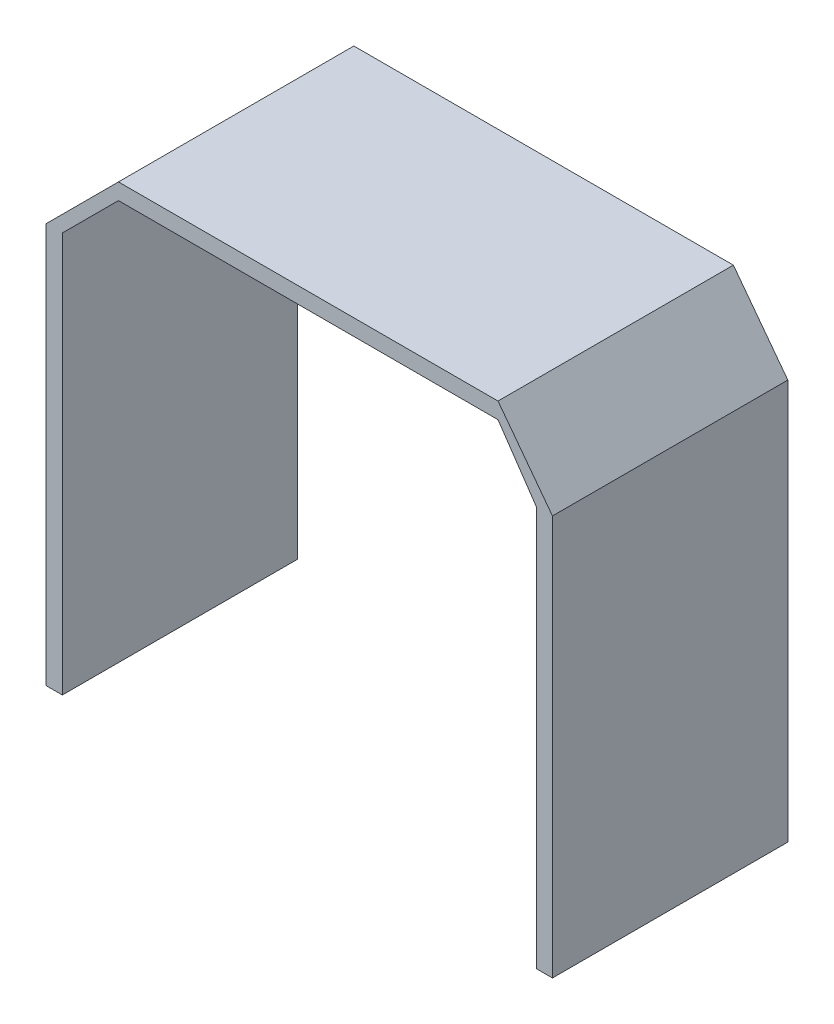
ISO-10303-21;
HEADER;
FILE_DESCRIPTION(('STEP AP214'),'2;1');
FILE_NAME('part.step','',(''),(''),'','','');
FILE_SCHEMA(('AUTOMOTIVE_DESIGN { 1 0 10303 214 1 1 1 1 }'));
ENDSEC;
DATA;
#1=APPLICATION_CONTEXT('core data for automotive mechanical design processes');
#2=APPLICATION_PROTOCOL_DEFINITION('international standard','automotive_design',2000,#1);
#3=PRODUCT_CONTEXT('',#1,'mechanical');
#4=PRODUCT('Part','Part','',(#3));
#5=PRODUCT_RELATED_PRODUCT_CATEGORY('part','',(#4));
#6=PRODUCT_DEFINITION_FORMATION('','',#4);
#7=PRODUCT_DEFINITION_CONTEXT('part definition',#1,'design');
#8=PRODUCT_DEFINITION('design','',#6,#7);
#9=PRODUCT_DEFINITION_SHAPE('','',#8);
#10=(LENGTH_UNIT() NAMED_UNIT(*) SI_UNIT(.MILLI.,.METRE.));
#11=(NAMED_UNIT(*) PLANE_ANGLE_UNIT() SI_UNIT($,.RADIAN.));
#12=(NAMED_UNIT(*) SI_UNIT($,.STERADIAN.) SOLID_ANGLE_UNIT());
#13=UNCERTAINTY_MEASURE_WITH_UNIT(LENGTH_MEASURE(1.E-05),#10,'distance_accuracy_value','');
#14=(GEOMETRIC_REPRESENTATION_CONTEXT(3) GLOBAL_UNCERTAINTY_ASSIGNED_CONTEXT((#13)) GLOBAL_UNIT_ASSIGNED_CONTEXT((#10,
#11,#12)) REPRESENTATION_CONTEXT('',''));
#15=CARTESIAN_POINT('',(0.,0.,0.));
#16=DIRECTION('',(0.,0.,1.));
#17=DIRECTION('',(1.,0.,0.));
#18=AXIS2_PLACEMENT_3D('',#15,#16,#17);
#19=CARTESIAN_POINT('',(-56.8011798622577,64.2288852711708,32.));
#20=DIRECTION('',(0.707106781186548,-0.707106781186547,0.));
#21=DIRECTION('',(0.707106781186547,0.707106781186548,0.));
#22=AXIS2_PLACEMENT_3D('',#19,#20,#21);
#23=PLANE('',#22);
#24=DIRECTION('',(-0.707106781186547,-0.707106781186548,0.));
#25=VECTOR('',#24,1.);
#26=CARTESIAN_POINT('',(-56.8011798622577,64.2288852711708,0.));
#27=LINE('',#26,#25);
#28=CARTESIAN_POINT('',(-56.8011798622577,64.2288852711708,0.));
#29=VERTEX_POINT('',#28);
#30=CARTESIAN_POINT('',(-66.6300651334285,54.4,0.));
#31=VERTEX_POINT('',#30);
#32=EDGE_CURVE('E160',#29,#31,#27,.T.);
#33=ORIENTED_EDGE('',*,*,#32,.T.);
#34=DIRECTION('',(0.,0.,-1.));
#35=VECTOR('',#34,1.);
#36=CARTESIAN_POINT('',(-66.6300651334285,54.4,32.));
#37=LINE('',#36,#35);
#38=CARTESIAN_POINT('',(-66.6300651334285,54.4,32.));
#39=VERTEX_POINT('',#38);
#40=EDGE_CURVE('E11',#39,#31,#37,.T.);
#41=ORIENTED_EDGE('',*,*,#40,.F.);
#42=DIRECTION('',(-0.707106781186547,-0.707106781186548,0.));
#43=VECTOR('',#42,1.);
#44=CARTESIAN_POINT('',(-56.8011798622577,64.2288852711708,32.));
#45=LINE('',#44,#43);
#46=CARTESIAN_POINT('',(-56.8011798622577,64.2288852711708,32.));
#47=VERTEX_POINT('',#46);
#48=EDGE_CURVE('E186',#47,#39,#45,.T.);
#49=ORIENTED_EDGE('',*,*,#48,.F.);
#50=DIRECTION('',(0.,0.,-1.));
#51=VECTOR('',#50,1.);
#52=CARTESIAN_POINT('',(-56.8011798622577,64.2288852711708,32.));
#53=LINE('',#52,#51);
#54=EDGE_CURVE('E156',#47,#29,#53,.T.);
#55=ORIENTED_EDGE('',*,*,#54,.T.);
#56=EDGE_LOOP('',(#33,#41,#49,#55));
#57=FACE_BOUND('',#56,.T.);
#58=ADVANCED_FACE('F41',(#57),#23,.F.);
#59=CARTESIAN_POINT('',(-66.6300651334285,54.4,32.));
#60=DIRECTION('',(1.,0.,0.));
#61=DIRECTION('',(0.,1.,0.));
#62=AXIS2_PLACEMENT_3D('',#59,#60,#61);
#63=PLANE('',#62);
#64=DIRECTION('',(0.,-1.,0.));
#65=VECTOR('',#64,1.);
#66=CARTESIAN_POINT('',(-66.6300651334285,54.4,0.));
#67=LINE('',#66,#65);
#68=CARTESIAN_POINT('',(-66.6300651334285,0.,0.));
#69=VERTEX_POINT('',#68);
#70=EDGE_CURVE('E163',#31,#69,#67,.T.);
#71=ORIENTED_EDGE('',*,*,#70,.T.);
#72=DIRECTION('',(0.,0.,-1.));
#73=VECTOR('',#72,1.);
#74=CARTESIAN_POINT('',(-66.6300651334285,0.,32.));
#75=LINE('',#74,#73);
#76=CARTESIAN_POINT('',(-66.6300651334285,0.,32.));
#77=VERTEX_POINT('',#76);
#78=EDGE_CURVE('E49',#77,#69,#75,.T.);
#79=ORIENTED_EDGE('',*,*,#78,.F.);
#80=DIRECTION('',(0.,-1.,0.));
#81=VECTOR('',#80,1.);
#82=CARTESIAN_POINT('',(-66.6300651334285,54.4,32.));
#83=LINE('',#82,#81);
#84=EDGE_CURVE('E108',#39,#77,#83,.T.);
#85=ORIENTED_EDGE('',*,*,#84,.F.);
#86=ORIENTED_EDGE('',*,*,#40,.T.);
#87=EDGE_LOOP('',(#71,#79,#85,#86));
#88=FACE_BOUND('',#87,.T.);
#89=ADVANCED_FACE('F260',(#88),#63,.F.);
#90=CARTESIAN_POINT('',(-66.6300651334285,0.,32.));
#91=DIRECTION('',(0.,1.,0.));
#92=DIRECTION('',(0.,0.,1.));
#93=AXIS2_PLACEMENT_3D('',#90,#91,#92);
#94=PLANE('',#93);
#95=DIRECTION('',(1.,0.,0.));
#96=VECTOR('',#95,1.);
#97=CARTESIAN_POINT('',(-66.6300651334285,0.,0.));
#98=LINE('',#97,#96);
#99=CARTESIAN_POINT('',(-64.4300651334285,0.,0.));
#100=VERTEX_POINT('',#99);
#101=EDGE_CURVE('E165',#69,#100,#98,.T.);
#102=ORIENTED_EDGE('',*,*,#101,.T.);
#103=DIRECTION('',(0.,0.,-1.));
#104=VECTOR('',#103,1.);
#105=CARTESIAN_POINT('',(-64.4300651334285,0.,32.));
#106=LINE('',#105,#104);
#107=CARTESIAN_POINT('',(-64.4300651334285,0.,32.));
#108=VERTEX_POINT('',#107);
#109=EDGE_CURVE('E203',#108,#100,#106,.T.);
#110=ORIENTED_EDGE('',*,*,#109,.F.);
#111=DIRECTION('',(1.,0.,0.));
#112=VECTOR('',#111,1.);
#113=CARTESIAN_POINT('',(-66.6300651334285,0.,32.));
#114=LINE('',#113,#112);
#115=EDGE_CURVE('E211',#77,#108,#114,.T.);
#116=ORIENTED_EDGE('',*,*,#115,.F.);
#117=ORIENTED_EDGE('',*,*,#78,.T.);
#118=EDGE_LOOP('',(#102,#110,#116,#117));
#119=FACE_BOUND('',#118,.T.);
#120=ADVANCED_FACE('F209',(#119),#94,.F.);
#121=CARTESIAN_POINT('',(-64.4300651334285,0.,32.));
#122=DIRECTION('',(-1.,0.,0.));
#123=DIRECTION('',(0.,0.,1.));
#124=AXIS2_PLACEMENT_3D('',#121,#122,#123);
#125=PLANE('',#124);
#126=DIRECTION('',(0.,1.,0.));
#127=VECTOR('',#126,1.);
#128=CARTESIAN_POINT('',(-64.4300651334285,0.,0.));
#129=LINE('',#128,#127);
#130=CARTESIAN_POINT('',(-64.4300651334285,54.4,0.));
#131=VERTEX_POINT('',#130);
#132=EDGE_CURVE('E167',#100,#131,#129,.T.);
#133=ORIENTED_EDGE('',*,*,#132,.T.);
#134=DIRECTION('',(0.,0.,-1.));
#135=VECTOR('',#134,1.);
#136=CARTESIAN_POINT('',(-64.4300651334285,54.4,32.));
#137=LINE('',#136,#135);
#138=CARTESIAN_POINT('',(-64.4300651334285,54.4,32.));
#139=VERTEX_POINT('',#138);
#140=EDGE_CURVE('E200',#139,#131,#137,.T.);
#141=ORIENTED_EDGE('',*,*,#140,.F.);
#142=DIRECTION('',(0.,1.,0.));
#143=VECTOR('',#142,1.);
#144=CARTESIAN_POINT('',(-64.4300651334285,0.,32.));
#145=LINE('',#144,#143);
#146=EDGE_CURVE('E229',#108,#139,#145,.T.);
#147=ORIENTED_EDGE('',*,*,#146,.F.);
#148=ORIENTED_EDGE('',*,*,#109,.T.);
#149=EDGE_LOOP('',(#133,#141,#147,#148));
#150=FACE_BOUND('',#149,.T.);
#151=ADVANCED_FACE('F220',(#150),#125,.F.);
#152=CARTESIAN_POINT('',(-64.4300651334285,54.4,32.));
#153=DIRECTION('',(-0.707106781186547,0.707106781186547,0.));
#154=DIRECTION('',(-0.707106781186548,-0.707106781186548,0.));
#155=AXIS2_PLACEMENT_3D('',#152,#153,#154);
#156=PLANE('',#155);
#157=DIRECTION('',(0.707106781186547,0.707106781186547,0.));
#158=VECTOR('',#157,1.);
#159=CARTESIAN_POINT('',(-64.4300651334285,54.4,0.));
#160=LINE('',#159,#158);
#161=CARTESIAN_POINT('',(-56.8011798622577,62.0288852711708,0.));
#162=VERTEX_POINT('',#161);
#163=EDGE_CURVE('E169',#131,#162,#160,.T.);
#164=ORIENTED_EDGE('',*,*,#163,.T.);
#165=DIRECTION('',(0.,0.,-1.));
#166=VECTOR('',#165,1.);
#167=CARTESIAN_POINT('',(-56.8011798622577,62.0288852711708,32.));
#168=LINE('',#167,#166);
#169=CARTESIAN_POINT('',(-56.8011798622577,62.0288852711708,32.));
#170=VERTEX_POINT('',#169);
#171=EDGE_CURVE('E197',#170,#162,#168,.T.);
#172=ORIENTED_EDGE('',*,*,#171,.F.);
#173=DIRECTION('',(0.707106781186547,0.707106781186547,0.));
#174=VECTOR('',#173,1.);
#175=CARTESIAN_POINT('',(-64.4300651334285,54.4,32.));
#176=LINE('',#175,#174);
#177=EDGE_CURVE('E226',#139,#170,#176,.T.);
#178=ORIENTED_EDGE('',*,*,#177,.F.);
#179=ORIENTED_EDGE('',*,*,#140,.T.);
#180=EDGE_LOOP('',(#164,#172,#178,#179));
#181=FACE_BOUND('',#180,.T.);
#182=ADVANCED_FACE('F224',(#181),#156,.F.);
#183=CARTESIAN_POINT('',(-56.8011798622577,62.0288852711708,32.));
#184=DIRECTION('',(0.,1.,0.));
#185=DIRECTION('',(0.,0.,1.));
#186=AXIS2_PLACEMENT_3D('',#183,#184,#185);
#187=PLANE('',#186);
#188=DIRECTION('',(1.,0.,0.));
#189=VECTOR('',#188,1.);
#190=CARTESIAN_POINT('',(-56.8011798622577,62.0288852711708,0.));
#191=LINE('',#190,#189);
#192=CARTESIAN_POINT('',(-5.20117986225772,62.0288852711708,0.));
#193=VERTEX_POINT('',#192);
#194=EDGE_CURVE('E171',#162,#193,#191,.T.);
#195=ORIENTED_EDGE('',*,*,#194,.T.);
#196=DIRECTION('',(0.,0.,-1.));
#197=VECTOR('',#196,1.);
#198=CARTESIAN_POINT('',(-5.20117986225772,62.0288852711708,32.));
#199=LINE('',#198,#197);
#200=CARTESIAN_POINT('',(-5.20117986225772,62.0288852711708,32.));
#201=VERTEX_POINT('',#200);
#202=EDGE_CURVE('E194',#201,#193,#199,.T.);
#203=ORIENTED_EDGE('',*,*,#202,.F.);
#204=DIRECTION('',(1.,0.,0.));
#205=VECTOR('',#204,1.);
#206=CARTESIAN_POINT('',(-56.8011798622577,62.0288852711708,32.));
#207=LINE('',#206,#205);
#208=EDGE_CURVE('E228',#170,#201,#207,.T.);
#209=ORIENTED_EDGE('',*,*,#208,.F.);
#210=ORIENTED_EDGE('',*,*,#171,.T.);
#211=EDGE_LOOP('',(#195,#203,#209,#210));
#212=FACE_BOUND('',#211,.T.);
#213=ADVANCED_FACE('F325',(#212),#187,.F.);
#214=CARTESIAN_POINT('',(-5.20117986225772,62.0288852711708,32.));
#215=DIRECTION('',(0.826244119964504,0.563312217357375,0.));
#216=DIRECTION('',(-0.563312217357375,0.826244119964504,0.));
#217=AXIS2_PLACEMENT_3D('',#214,#215,#216);
#218=PLANE('',#217);
#219=DIRECTION('',(0.563312217357375,-0.826244119964504,0.));
#220=VECTOR('',#219,1.);
#221=CARTESIAN_POINT('',(-5.20117986225772,62.0288852711708,0.));
#222=LINE('',#221,#220);
#223=CARTESIAN_POINT('',(0.,54.4,0.));
#224=VERTEX_POINT('',#223);
#225=EDGE_CURVE('E173',#193,#224,#222,.T.);
#226=ORIENTED_EDGE('',*,*,#225,.T.);
#227=DIRECTION('',(0.,0.,-1.));
#228=VECTOR('',#227,1.);
#229=CARTESIAN_POINT('',(0.,54.4,32.));
#230=LINE('',#229,#228);
#231=CARTESIAN_POINT('',(0.,54.4,32.));
#232=VERTEX_POINT('',#231);
#233=EDGE_CURVE('E192',#232,#224,#230,.T.);
#234=ORIENTED_EDGE('',*,*,#233,.F.);
#235=DIRECTION('',(0.563312217357375,-0.826244119964504,0.));
#236=VECTOR('',#235,1.);
#237=CARTESIAN_POINT('',(-5.20117986225772,62.0288852711708,32.));
#238=LINE('',#237,#236);
#239=EDGE_CURVE('E231',#201,#232,#238,.T.);
#240=ORIENTED_EDGE('',*,*,#239,.F.);
#241=ORIENTED_EDGE('',*,*,#202,.T.);
#242=EDGE_LOOP('',(#226,#234,#240,#241));
#243=FACE_BOUND('',#242,.T.);
#244=ADVANCED_FACE('F246',(#243),#218,.F.);
#245=CARTESIAN_POINT('',(0.,0.,32.));
#246=DIRECTION('',(-1.,0.,0.));
#247=DIRECTION('',(0.,0.,1.));
#248=AXIS2_PLACEMENT_3D('',#245,#246,#247);
#249=PLANE('',#248);
#250=DIRECTION('',(0.,1.,0.));
#251=VECTOR('',#250,1.);
#252=CARTESIAN_POINT('',(0.,0.,0.));
#253=LINE('',#252,#251);
#254=CARTESIAN_POINT('',(0.,0.,0.));
#255=VERTEX_POINT('',#254);
#256=EDGE_CURVE('E176',#255,#224,#253,.T.);
#257=ORIENTED_EDGE('',*,*,#256,.F.);
#258=DIRECTION('',(0.,0.,-1.));
#259=VECTOR('',#258,1.);
#260=CARTESIAN_POINT('',(0.,0.,32.));
#261=LINE('',#260,#259);
#262=CARTESIAN_POINT('',(0.,0.,32.));
#263=VERTEX_POINT('',#262);
#264=EDGE_CURVE('E190',#263,#255,#261,.T.);
#265=ORIENTED_EDGE('',*,*,#264,.F.);
#266=DIRECTION('',(0.,1.,0.));
#267=VECTOR('',#266,1.);
#268=CARTESIAN_POINT('',(0.,0.,32.));
#269=LINE('',#268,#267);
#270=EDGE_CURVE('E237',#263,#232,#269,.T.);
#271=ORIENTED_EDGE('',*,*,#270,.T.);
#272=ORIENTED_EDGE('',*,*,#233,.T.);
#273=EDGE_LOOP('',(#257,#265,#271,#272));
#274=FACE_BOUND('',#273,.T.);
#275=ADVANCED_FACE('F241',(#274),#249,.T.);
#276=CARTESIAN_POINT('',(0.,0.,32.));
#277=DIRECTION('',(-0.000125343191531866,0.999999992144542,0.));
#278=DIRECTION('',(-0.999999992144542,-0.000125343191531866,0.));
#279=AXIS2_PLACEMENT_3D('',#276,#277,#278);
#280=PLANE('',#279);
#281=DIRECTION('',(0.999999992144542,0.000125343191531866,0.));
#282=VECTOR('',#281,1.);
#283=CARTESIAN_POINT('',(0.,0.,0.));
#284=LINE('',#283,#282);
#285=CARTESIAN_POINT('',(2.20000000000001,0.000275755023536288,0.));
#286=VERTEX_POINT('',#285);
#287=EDGE_CURVE('E179',#255,#286,#284,.T.);
#288=ORIENTED_EDGE('',*,*,#287,.T.);
#289=DIRECTION('',(0.,0.,-1.));
#290=VECTOR('',#289,1.);
#291=CARTESIAN_POINT('',(2.20000000000001,0.000275755023536288,32.));
#292=LINE('',#291,#290);
#293=CARTESIAN_POINT('',(2.20000000000001,0.000275755023536288,32.));
#294=VERTEX_POINT('',#293);
#295=EDGE_CURVE('E145',#294,#286,#292,.T.);
#296=ORIENTED_EDGE('',*,*,#295,.F.);
#297=DIRECTION('',(0.999999992144542,0.000125343191531866,0.));
#298=VECTOR('',#297,1.);
#299=CARTESIAN_POINT('',(0.,0.,32.));
#300=LINE('',#299,#298);
#301=EDGE_CURVE('E151',#263,#294,#300,.T.);
#302=ORIENTED_EDGE('',*,*,#301,.F.);
#303=ORIENTED_EDGE('',*,*,#264,.T.);
#304=EDGE_LOOP('',(#288,#296,#302,#303));
#305=FACE_BOUND('',#304,.T.);
#306=ADVANCED_FACE('F250',(#305),#280,.F.);
#307=CARTESIAN_POINT('',(2.2,54.4,32.));
#308=DIRECTION('',(1.,0.,0.));
#309=DIRECTION('',(0.,1.,0.));
#310=AXIS2_PLACEMENT_3D('',#307,#308,#309);
#311=PLANE('',#310);
#312=DIRECTION('',(0.,-1.,0.));
#313=VECTOR('',#312,1.);
#314=CARTESIAN_POINT('',(2.2,54.4,0.));
#315=LINE('',#314,#313);
#316=CARTESIAN_POINT('',(2.2,54.4,0.));
#317=VERTEX_POINT('',#316);
#318=EDGE_CURVE('E140',#317,#286,#315,.T.);
#319=ORIENTED_EDGE('',*,*,#318,.F.);
#320=DIRECTION('',(0.,0.,-1.));
#321=VECTOR('',#320,1.);
#322=CARTESIAN_POINT('',(2.2,54.4,32.));
#323=LINE('',#322,#321);
#324=CARTESIAN_POINT('',(2.2,54.4,32.));
#325=VERTEX_POINT('',#324);
#326=EDGE_CURVE('E135',#325,#317,#323,.T.);
#327=ORIENTED_EDGE('',*,*,#326,.F.);
#328=DIRECTION('',(0.,-1.,0.));
#329=VECTOR('',#328,1.);
#330=CARTESIAN_POINT('',(2.2,54.4,32.));
#331=LINE('',#330,#329);
#332=EDGE_CURVE('E138',#325,#294,#331,.T.);
#333=ORIENTED_EDGE('',*,*,#332,.T.);
#334=ORIENTED_EDGE('',*,*,#295,.T.);
#335=EDGE_LOOP('',(#319,#327,#333,#334));
#336=FACE_BOUND('',#335,.T.);
#337=ADVANCED_FACE('F137',(#336),#311,.T.);
#338=CARTESIAN_POINT('',(-5.20117986225772,64.2288852711708,32.));
#339=DIRECTION('',(0.798847045794215,0.601534203039075,0.));
#340=DIRECTION('',(-0.601534203039075,0.798847045794215,0.));
#341=AXIS2_PLACEMENT_3D('',#338,#339,#340);
#342=PLANE('',#341);
#343=DIRECTION('',(0.601534203039075,-0.798847045794215,0.));
#344=VECTOR('',#343,1.);
#345=CARTESIAN_POINT('',(-5.20117986225772,64.2288852711708,0.));
#346=LINE('',#345,#344);
#347=CARTESIAN_POINT('',(-5.20117986225772,64.2288852711708,0.));
#348=VERTEX_POINT('',#347);
#349=EDGE_CURVE('E183',#348,#317,#346,.T.);
#350=ORIENTED_EDGE('',*,*,#349,.F.);
#351=DIRECTION('',(0.,0.,-1.));
#352=VECTOR('',#351,1.);
#353=CARTESIAN_POINT('',(-5.20117986225772,64.2288852711708,32.));
#354=LINE('',#353,#352);
#355=CARTESIAN_POINT('',(-5.20117986225772,64.2288852711708,32.));
#356=VERTEX_POINT('',#355);
#357=EDGE_CURVE('E97',#356,#348,#354,.T.);
#358=ORIENTED_EDGE('',*,*,#357,.F.);
#359=DIRECTION('',(0.601534203039075,-0.798847045794215,0.));
#360=VECTOR('',#359,1.);
#361=CARTESIAN_POINT('',(-5.20117986225772,64.2288852711708,32.));
#362=LINE('',#361,#360);
#363=EDGE_CURVE('E148',#356,#325,#362,.T.);
#364=ORIENTED_EDGE('',*,*,#363,.T.);
#365=ORIENTED_EDGE('',*,*,#326,.T.);
#366=EDGE_LOOP('',(#350,#358,#364,#365));
#367=FACE_BOUND('',#366,.T.);
#368=ADVANCED_FACE('F154',(#367),#342,.T.);
#369=CARTESIAN_POINT('',(-5.20117986225772,64.2288852711708,32.));
#370=DIRECTION('',(0.,-1.,0.));
#371=DIRECTION('',(0.,0.,-1.));
#372=AXIS2_PLACEMENT_3D('',#369,#370,#371);
#373=PLANE('',#372);
#374=DIRECTION('',(-1.,0.,0.));
#375=VECTOR('',#374,1.);
#376=CARTESIAN_POINT('',(-5.20117986225772,64.2288852711708,0.));
#377=LINE('',#376,#375);
#378=EDGE_CURVE('E100',#348,#29,#377,.T.);
#379=ORIENTED_EDGE('',*,*,#378,.T.);
#380=ORIENTED_EDGE('',*,*,#54,.F.);
#381=DIRECTION('',(-1.,0.,0.));
#382=VECTOR('',#381,1.);
#383=CARTESIAN_POINT('',(-5.20117986225772,64.2288852711708,32.));
#384=LINE('',#383,#382);
#385=EDGE_CURVE('E57',#356,#47,#384,.T.);
#386=ORIENTED_EDGE('',*,*,#385,.F.);
#387=ORIENTED_EDGE('',*,*,#357,.T.);
#388=EDGE_LOOP('',(#379,#380,#386,#387));
#389=FACE_BOUND('',#388,.T.);
#390=ADVANCED_FACE('F267',(#389),#373,.F.);
#391=CARTESIAN_POINT('',(0.,0.,32.));
#392=DIRECTION('',(0.,0.,1.));
#393=DIRECTION('',(1.,0.,0.));
#394=AXIS2_PLACEMENT_3D('',#391,#392,#393);
#395=PLANE('',#394);
#396=ORIENTED_EDGE('',*,*,#48,.T.);
#397=ORIENTED_EDGE('',*,*,#84,.T.);
#398=ORIENTED_EDGE('',*,*,#115,.T.);
#399=ORIENTED_EDGE('',*,*,#146,.T.);
#400=ORIENTED_EDGE('',*,*,#177,.T.);
#401=ORIENTED_EDGE('',*,*,#208,.T.);
#402=ORIENTED_EDGE('',*,*,#239,.T.);
#403=ORIENTED_EDGE('',*,*,#270,.F.);
#404=ORIENTED_EDGE('',*,*,#301,.T.);
#405=ORIENTED_EDGE('',*,*,#332,.F.);
#406=ORIENTED_EDGE('',*,*,#363,.F.);
#407=ORIENTED_EDGE('',*,*,#385,.T.);
#408=EDGE_LOOP('',(#396,#397,#398,#399,#400,#401,#402,#403,#404,#405,#406,#407));
#409=FACE_BOUND('',#408,.T.);
#410=ADVANCED_FACE('F147',(#409),#395,.T.);
#411=CARTESIAN_POINT('',(0.,0.,0.));
#412=DIRECTION('',(0.,0.,1.));
#413=DIRECTION('',(1.,0.,0.));
#414=AXIS2_PLACEMENT_3D('',#411,#412,#413);
#415=PLANE('',#414);
#416=ORIENTED_EDGE('',*,*,#32,.F.);
#417=ORIENTED_EDGE('',*,*,#378,.F.);
#418=ORIENTED_EDGE('',*,*,#349,.T.);
#419=ORIENTED_EDGE('',*,*,#318,.T.);
#420=ORIENTED_EDGE('',*,*,#287,.F.);
#421=ORIENTED_EDGE('',*,*,#256,.T.);
#422=ORIENTED_EDGE('',*,*,#225,.F.);
#423=ORIENTED_EDGE('',*,*,#194,.F.);
#424=ORIENTED_EDGE('',*,*,#163,.F.);
#425=ORIENTED_EDGE('',*,*,#132,.F.);
#426=ORIENTED_EDGE('',*,*,#101,.F.);
#427=ORIENTED_EDGE('',*,*,#70,.F.);
#428=EDGE_LOOP('',(#416,#417,#418,#419,#420,#421,#422,#423,#424,#425,#426,#427));
#429=FACE_BOUND('',#428,.T.);
#430=ADVANCED_FACE('F215',(#429),#415,.F.);
#431=CLOSED_SHELL('',(#58,#89,#120,#151,#182,#213,#244,#275,#306,#337,#368,#390,#410,#430));
#432=MANIFOLD_SOLID_BREP('B2',#431);
#433=ADVANCED_BREP_SHAPE_REPRESENTATION('',(#18,#432),#14);
#434=SHAPE_DEFINITION_REPRESENTATION(#9,#433);
ENDSEC;
END-ISO-10303-21;
